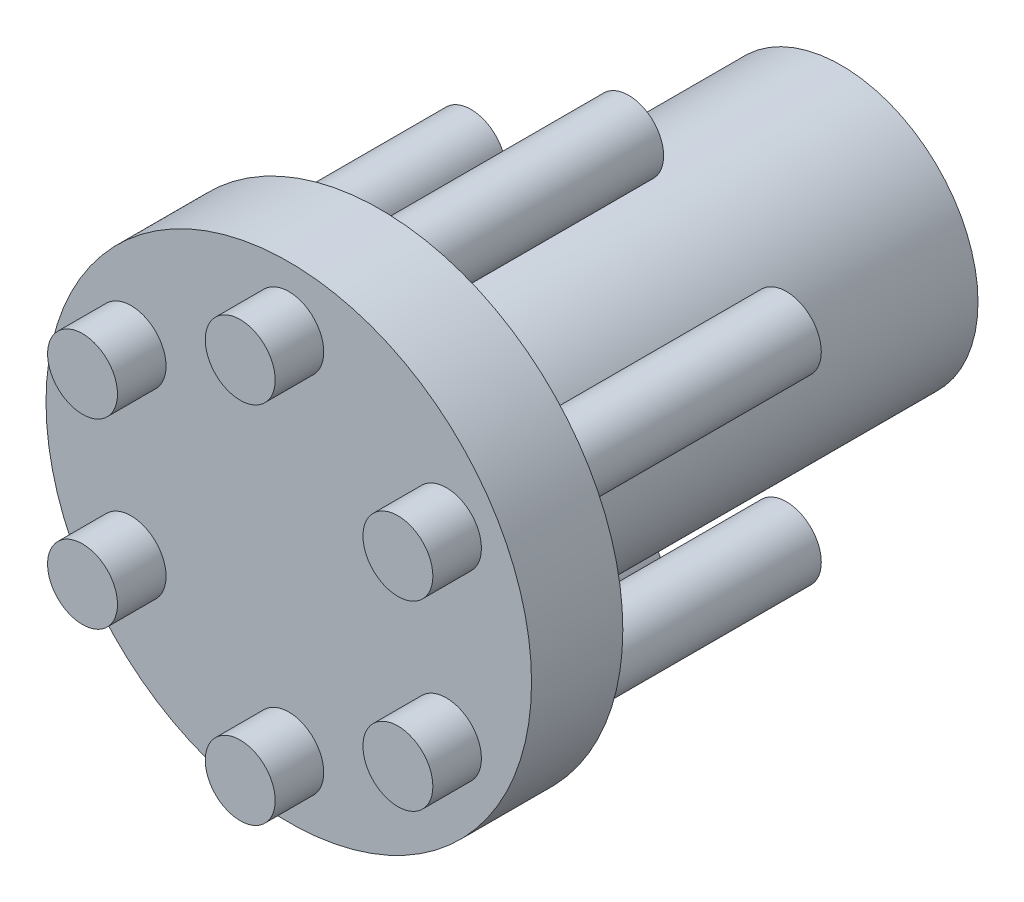
ISO-10303-21;
HEADER;
FILE_DESCRIPTION(('STEP AP214'),'2;1');
FILE_NAME('part.step','',(''),(''),'','','');
FILE_SCHEMA(('AUTOMOTIVE_DESIGN { 1 0 10303 214 1 1 1 1 }'));
ENDSEC;
DATA;
#1=APPLICATION_CONTEXT('core data for automotive mechanical design processes');
#2=APPLICATION_PROTOCOL_DEFINITION('international standard','automotive_design',2000,#1);
#3=PRODUCT_CONTEXT('',#1,'mechanical');
#4=PRODUCT('Part','Part','',(#3));
#5=PRODUCT_RELATED_PRODUCT_CATEGORY('part','',(#4));
#6=PRODUCT_DEFINITION_FORMATION('','',#4);
#7=PRODUCT_DEFINITION_CONTEXT('part definition',#1,'design');
#8=PRODUCT_DEFINITION('design','',#6,#7);
#9=PRODUCT_DEFINITION_SHAPE('','',#8);
#10=(LENGTH_UNIT() NAMED_UNIT(*) SI_UNIT(.MILLI.,.METRE.));
#11=(NAMED_UNIT(*) PLANE_ANGLE_UNIT() SI_UNIT($,.RADIAN.));
#12=(NAMED_UNIT(*) SI_UNIT($,.STERADIAN.) SOLID_ANGLE_UNIT());
#13=UNCERTAINTY_MEASURE_WITH_UNIT(LENGTH_MEASURE(1.E-05),#10,'distance_accuracy_value','');
#14=(GEOMETRIC_REPRESENTATION_CONTEXT(3) GLOBAL_UNCERTAINTY_ASSIGNED_CONTEXT((#13)) GLOBAL_UNIT_ASSIGNED_CONTEXT((#10,
#11,#12)) REPRESENTATION_CONTEXT('',''));
#15=CARTESIAN_POINT('',(0.,0.,0.));
#16=DIRECTION('',(0.,0.,1.));
#17=DIRECTION('',(1.,0.,0.));
#18=AXIS2_PLACEMENT_3D('',#15,#16,#17);
#19=CARTESIAN_POINT('',(0.,0.,0.));
#20=DIRECTION('',(0.,0.,1.));
#21=DIRECTION('',(1.,0.,0.));
#22=AXIS2_PLACEMENT_3D('',#19,#20,#21);
#23=PLANE('',#22);
#24=CARTESIAN_POINT('',(-8.24889197104655,4.76249999999958,0.));
#25=DIRECTION('',(0.,0.,1.));
#26=DIRECTION('',(1.,0.,0.));
#27=AXIS2_PLACEMENT_3D('',#24,#25,#26);
#28=CIRCLE('',#27,1.8288);
#29=CARTESIAN_POINT('',(-6.42009197104655,4.76249999999958,0.));
#30=VERTEX_POINT('',#29);
#31=EDGE_CURVE('E116',#30,#30,#28,.T.);
#32=ORIENTED_EDGE('',*,*,#31,.T.);
#33=EDGE_LOOP('',(#32));
#34=FACE_BOUND('',#33,.T.);
#35=CARTESIAN_POINT('',(-8.24889197104607,-4.76250000000041,0.));
#36=DIRECTION('',(0.,0.,1.));
#37=DIRECTION('',(1.,0.,0.));
#38=AXIS2_PLACEMENT_3D('',#35,#36,#37);
#39=CIRCLE('',#38,1.8288);
#40=CARTESIAN_POINT('',(-6.42009197104607,-4.76250000000041,0.));
#41=VERTEX_POINT('',#40);
#42=EDGE_CURVE('E107',#41,#41,#39,.T.);
#43=ORIENTED_EDGE('',*,*,#42,.T.);
#44=EDGE_LOOP('',(#43));
#45=FACE_BOUND('',#44,.T.);
#46=CARTESIAN_POINT('',(9.44592547945624E-13,-9.525,0.));
#47=DIRECTION('',(0.,0.,1.));
#48=DIRECTION('',(1.,0.,0.));
#49=AXIS2_PLACEMENT_3D('',#46,#47,#48);
#50=CIRCLE('',#49,1.8288);
#51=CARTESIAN_POINT('',(1.82880000000094,-9.525,0.));
#52=VERTEX_POINT('',#51);
#53=EDGE_CURVE('E98',#52,#52,#50,.T.);
#54=ORIENTED_EDGE('',*,*,#53,.T.);
#55=EDGE_LOOP('',(#54));
#56=FACE_BOUND('',#55,.T.);
#57=CARTESIAN_POINT('',(8.24889197104749,-4.76249999999959,0.));
#58=DIRECTION('',(0.,0.,1.));
#59=DIRECTION('',(1.,0.,0.));
#60=AXIS2_PLACEMENT_3D('',#57,#58,#59);
#61=CIRCLE('',#60,1.8288);
#62=CARTESIAN_POINT('',(10.0776919710475,-4.76249999999959,0.));
#63=VERTEX_POINT('',#62);
#64=EDGE_CURVE('E89',#63,#63,#61,.T.);
#65=ORIENTED_EDGE('',*,*,#64,.T.);
#66=EDGE_LOOP('',(#65));
#67=FACE_BOUND('',#66,.T.);
#68=CARTESIAN_POINT('',(8.24889197104701,4.76250000000041,0.));
#69=DIRECTION('',(0.,0.,1.));
#70=DIRECTION('',(1.,0.,0.));
#71=AXIS2_PLACEMENT_3D('',#68,#69,#70);
#72=CIRCLE('',#71,1.8288);
#73=CARTESIAN_POINT('',(10.077691971047,4.76250000000041,0.));
#74=VERTEX_POINT('',#73);
#75=EDGE_CURVE('E80',#74,#74,#72,.T.);
#76=ORIENTED_EDGE('',*,*,#75,.T.);
#77=EDGE_LOOP('',(#76));
#78=FACE_BOUND('',#77,.T.);
#79=CARTESIAN_POINT('',(0.,9.525,0.));
#80=DIRECTION('',(0.,0.,1.));
#81=DIRECTION('',(1.,0.,0.));
#82=AXIS2_PLACEMENT_3D('',#79,#80,#81);
#83=CIRCLE('',#82,1.8288);
#84=CARTESIAN_POINT('',(1.8288,9.525,0.));
#85=VERTEX_POINT('',#84);
#86=EDGE_CURVE('E71',#85,#85,#83,.T.);
#87=ORIENTED_EDGE('',*,*,#86,.T.);
#88=EDGE_LOOP('',(#87));
#89=FACE_BOUND('',#88,.T.);
#90=CARTESIAN_POINT('',(0.,0.,0.));
#91=DIRECTION('',(0.,0.,1.));
#92=DIRECTION('',(1.,0.,0.));
#93=AXIS2_PLACEMENT_3D('',#90,#91,#92);
#94=CIRCLE('',#93,12.7);
#95=CARTESIAN_POINT('',(12.7,0.,0.));
#96=VERTEX_POINT('',#95);
#97=EDGE_CURVE('E63',#96,#96,#94,.T.);
#98=ORIENTED_EDGE('',*,*,#97,.F.);
#99=EDGE_LOOP('',(#98));
#100=FACE_BOUND('',#99,.T.);
#101=CARTESIAN_POINT('',(0.,0.,0.));
#102=DIRECTION('',(0.,0.,1.));
#103=DIRECTION('',(1.,0.,0.));
#104=AXIS2_PLACEMENT_3D('',#101,#102,#103);
#105=CIRCLE('',#104,7.1501);
#106=CARTESIAN_POINT('',(7.1501,0.,0.));
#107=VERTEX_POINT('',#106);
#108=EDGE_CURVE('E59',#107,#107,#105,.F.);
#109=ORIENTED_EDGE('',*,*,#108,.F.);
#110=EDGE_LOOP('',(#109));
#111=FACE_BOUND('',#110,.T.);
#112=ADVANCED_FACE('F33',(#34,#45,#56,#67,#78,#89,#100,#111),#23,.F.);
#113=CARTESIAN_POINT('',(0.,0.,4.7752));
#114=DIRECTION('',(0.,0.,-1.));
#115=DIRECTION('',(-1.,0.,0.));
#116=AXIS2_PLACEMENT_3D('',#113,#114,#115);
#117=CYLINDRICAL_SURFACE('',#116,12.7);
#118=CARTESIAN_POINT('',(0.,0.,4.7752));
#119=DIRECTION('',(0.,0.,1.));
#120=DIRECTION('',(1.,0.,0.));
#121=AXIS2_PLACEMENT_3D('',#118,#119,#120);
#122=CIRCLE('',#121,12.7);
#123=CARTESIAN_POINT('',(12.7,0.,4.7752));
#124=VERTEX_POINT('',#123);
#125=EDGE_CURVE('E62',#124,#124,#122,.T.);
#126=ORIENTED_EDGE('',*,*,#125,.F.);
#127=EDGE_LOOP('',(#126));
#128=FACE_BOUND('',#127,.T.);
#129=ORIENTED_EDGE('',*,*,#97,.T.);
#130=EDGE_LOOP('',(#129));
#131=FACE_BOUND('',#130,.T.);
#132=ADVANCED_FACE('F35',(#128,#131),#117,.T.);
#133=CARTESIAN_POINT('',(0.,0.,4.7752));
#134=DIRECTION('',(0.,0.,1.));
#135=DIRECTION('',(1.,0.,0.));
#136=AXIS2_PLACEMENT_3D('',#133,#134,#135);
#137=PLANE('',#136);
#138=CARTESIAN_POINT('',(-8.24889197104655,4.76249999999958,4.7752));
#139=DIRECTION('',(0.,0.,1.));
#140=DIRECTION('',(1.,0.,0.));
#141=AXIS2_PLACEMENT_3D('',#138,#139,#140);
#142=CIRCLE('',#141,1.8288);
#143=CARTESIAN_POINT('',(-6.42009197104655,4.76249999999958,4.7752));
#144=VERTEX_POINT('',#143);
#145=EDGE_CURVE('E10',#144,#144,#142,.T.);
#146=ORIENTED_EDGE('',*,*,#145,.F.);
#147=EDGE_LOOP('',(#146));
#148=FACE_BOUND('',#147,.T.);
#149=CARTESIAN_POINT('',(-8.24889197104607,-4.76250000000041,4.7752));
#150=DIRECTION('',(0.,0.,1.));
#151=DIRECTION('',(1.,0.,0.));
#152=AXIS2_PLACEMENT_3D('',#149,#150,#151);
#153=CIRCLE('',#152,1.8288);
#154=CARTESIAN_POINT('',(-6.42009197104607,-4.76250000000041,4.7752));
#155=VERTEX_POINT('',#154);
#156=EDGE_CURVE('E40',#155,#155,#153,.T.);
#157=ORIENTED_EDGE('',*,*,#156,.F.);
#158=EDGE_LOOP('',(#157));
#159=FACE_BOUND('',#158,.T.);
#160=CARTESIAN_POINT('',(9.44592547945624E-13,-9.525,4.7752));
#161=DIRECTION('',(0.,0.,1.));
#162=DIRECTION('',(1.,0.,0.));
#163=AXIS2_PLACEMENT_3D('',#160,#161,#162);
#164=CIRCLE('',#163,1.8288);
#165=CARTESIAN_POINT('',(1.82880000000094,-9.525,4.7752));
#166=VERTEX_POINT('',#165);
#167=EDGE_CURVE('E44',#166,#166,#164,.T.);
#168=ORIENTED_EDGE('',*,*,#167,.F.);
#169=EDGE_LOOP('',(#168));
#170=FACE_BOUND('',#169,.T.);
#171=CARTESIAN_POINT('',(8.24889197104749,-4.76249999999959,4.7752));
#172=DIRECTION('',(0.,0.,1.));
#173=DIRECTION('',(1.,0.,0.));
#174=AXIS2_PLACEMENT_3D('',#171,#172,#173);
#175=CIRCLE('',#174,1.8288);
#176=CARTESIAN_POINT('',(10.0776919710475,-4.76249999999959,4.7752));
#177=VERTEX_POINT('',#176);
#178=EDGE_CURVE('E48',#177,#177,#175,.T.);
#179=ORIENTED_EDGE('',*,*,#178,.F.);
#180=EDGE_LOOP('',(#179));
#181=FACE_BOUND('',#180,.T.);
#182=CARTESIAN_POINT('',(8.24889197104701,4.76250000000041,4.7752));
#183=DIRECTION('',(0.,0.,1.));
#184=DIRECTION('',(1.,0.,0.));
#185=AXIS2_PLACEMENT_3D('',#182,#183,#184);
#186=CIRCLE('',#185,1.8288);
#187=CARTESIAN_POINT('',(10.077691971047,4.76250000000041,4.7752));
#188=VERTEX_POINT('',#187);
#189=EDGE_CURVE('E53',#188,#188,#186,.T.);
#190=ORIENTED_EDGE('',*,*,#189,.F.);
#191=EDGE_LOOP('',(#190));
#192=FACE_BOUND('',#191,.T.);
#193=CARTESIAN_POINT('',(0.,9.525,4.7752));
#194=DIRECTION('',(0.,0.,1.));
#195=DIRECTION('',(1.,0.,0.));
#196=AXIS2_PLACEMENT_3D('',#193,#194,#195);
#197=CIRCLE('',#196,1.8288);
#198=CARTESIAN_POINT('',(1.8288,9.525,4.7752));
#199=VERTEX_POINT('',#198);
#200=EDGE_CURVE('E56',#199,#199,#197,.T.);
#201=ORIENTED_EDGE('',*,*,#200,.F.);
#202=EDGE_LOOP('',(#201));
#203=FACE_BOUND('',#202,.T.);
#204=ORIENTED_EDGE('',*,*,#125,.T.);
#205=EDGE_LOOP('',(#204));
#206=FACE_BOUND('',#205,.T.);
#207=ADVANCED_FACE('F147',(#148,#159,#170,#181,#192,#203,#206),#137,.T.);
#208=CARTESIAN_POINT('',(0.,0.,-24.13));
#209=DIRECTION('',(0.,0.,1.));
#210=DIRECTION('',(1.,0.,0.));
#211=AXIS2_PLACEMENT_3D('',#208,#209,#210);
#212=CYLINDRICAL_SURFACE('',#211,7.1501);
#213=CARTESIAN_POINT('',(0.,0.,-24.13));
#214=DIRECTION('',(0.,0.,-1.));
#215=DIRECTION('',(-1.,0.,0.));
#216=AXIS2_PLACEMENT_3D('',#213,#214,#215);
#217=CIRCLE('',#216,7.1501);
#218=CARTESIAN_POINT('',(-7.1501,0.,-24.13));
#219=VERTEX_POINT('',#218);
#220=EDGE_CURVE('E66',#219,#219,#217,.T.);
#221=ORIENTED_EDGE('',*,*,#220,.F.);
#222=EDGE_LOOP('',(#221));
#223=FACE_BOUND('',#222,.T.);
#224=ORIENTED_EDGE('',*,*,#108,.T.);
#225=EDGE_LOOP('',(#224));
#226=FACE_BOUND('',#225,.T.);
#227=ADVANCED_FACE('F153',(#223,#226),#212,.T.);
#228=CARTESIAN_POINT('',(0.,0.,-24.13));
#229=DIRECTION('',(0.,0.,-1.));
#230=DIRECTION('',(-1.,0.,0.));
#231=AXIS2_PLACEMENT_3D('',#228,#229,#230);
#232=PLANE('',#231);
#233=ORIENTED_EDGE('',*,*,#220,.T.);
#234=EDGE_LOOP('',(#233));
#235=FACE_BOUND('',#234,.T.);
#236=ADVANCED_FACE('F157',(#235),#232,.T.);
#237=CARTESIAN_POINT('',(0.,9.525,7.3152));
#238=DIRECTION('',(0.,0.,1.));
#239=DIRECTION('',(1.,0.,0.));
#240=AXIS2_PLACEMENT_3D('',#237,#238,#239);
#241=PLANE('',#240);
#242=CARTESIAN_POINT('',(0.,9.525,7.3152));
#243=DIRECTION('',(0.,0.,1.));
#244=DIRECTION('',(1.,0.,0.));
#245=AXIS2_PLACEMENT_3D('',#242,#243,#244);
#246=CIRCLE('',#245,1.8288);
#247=CARTESIAN_POINT('',(1.8288,9.525,7.3152));
#248=VERTEX_POINT('',#247);
#249=EDGE_CURVE('E77',#248,#248,#246,.T.);
#250=ORIENTED_EDGE('',*,*,#249,.T.);
#251=EDGE_LOOP('',(#250));
#252=FACE_BOUND('',#251,.T.);
#253=ADVANCED_FACE('F161',(#252),#241,.T.);
#254=CARTESIAN_POINT('',(0.,9.525,-13.0048));
#255=DIRECTION('',(0.,0.,1.));
#256=DIRECTION('',(1.,0.,0.));
#257=AXIS2_PLACEMENT_3D('',#254,#255,#256);
#258=CYLINDRICAL_SURFACE('',#257,1.8288);
#259=ORIENTED_EDGE('',*,*,#200,.T.);
#260=EDGE_LOOP('',(#259));
#261=FACE_BOUND('',#260,.T.);
#262=ORIENTED_EDGE('',*,*,#249,.F.);
#263=EDGE_LOOP('',(#262));
#264=FACE_BOUND('',#263,.T.);
#265=ADVANCED_FACE('F163',(#261,#264),#258,.T.);
#266=CARTESIAN_POINT('',(0.,9.525,-13.0048));
#267=DIRECTION('',(0.,0.,1.));
#268=DIRECTION('',(1.,0.,0.));
#269=AXIS2_PLACEMENT_3D('',#266,#267,#268);
#270=CIRCLE('',#269,1.8288);
#271=CARTESIAN_POINT('',(1.8288,9.525,-13.0048));
#272=VERTEX_POINT('',#271);
#273=EDGE_CURVE('E74',#272,#272,#270,.T.);
#274=ORIENTED_EDGE('',*,*,#273,.T.);
#275=EDGE_LOOP('',(#274));
#276=FACE_BOUND('',#275,.T.);
#277=ORIENTED_EDGE('',*,*,#86,.F.);
#278=EDGE_LOOP('',(#277));
#279=FACE_BOUND('',#278,.T.);
#280=ADVANCED_FACE('F166',(#276,#279),#258,.T.);
#281=CARTESIAN_POINT('',(0.,9.525,-13.0048));
#282=DIRECTION('',(0.,0.,1.));
#283=DIRECTION('',(1.,0.,0.));
#284=AXIS2_PLACEMENT_3D('',#281,#282,#283);
#285=PLANE('',#284);
#286=ORIENTED_EDGE('',*,*,#273,.F.);
#287=EDGE_LOOP('',(#286));
#288=FACE_BOUND('',#287,.T.);
#289=ADVANCED_FACE('F168',(#288),#285,.F.);
#290=CARTESIAN_POINT('',(8.24889197104701,4.76250000000041,7.3152));
#291=DIRECTION('',(0.,0.,1.));
#292=DIRECTION('',(1.,0.,0.));
#293=AXIS2_PLACEMENT_3D('',#290,#291,#292);
#294=PLANE('',#293);
#295=CARTESIAN_POINT('',(8.24889197104701,4.76250000000041,7.3152));
#296=DIRECTION('',(0.,0.,1.));
#297=DIRECTION('',(1.,0.,0.));
#298=AXIS2_PLACEMENT_3D('',#295,#296,#297);
#299=CIRCLE('',#298,1.8288);
#300=CARTESIAN_POINT('',(10.077691971047,4.76250000000041,7.3152));
#301=VERTEX_POINT('',#300);
#302=EDGE_CURVE('E86',#301,#301,#299,.T.);
#303=ORIENTED_EDGE('',*,*,#302,.T.);
#304=EDGE_LOOP('',(#303));
#305=FACE_BOUND('',#304,.T.);
#306=ADVANCED_FACE('F171',(#305),#294,.T.);
#307=CARTESIAN_POINT('',(8.24889197104701,4.76250000000041,-13.0048));
#308=DIRECTION('',(0.,0.,1.));
#309=DIRECTION('',(1.,0.,0.));
#310=AXIS2_PLACEMENT_3D('',#307,#308,#309);
#311=CYLINDRICAL_SURFACE('',#310,1.8288);
#312=ORIENTED_EDGE('',*,*,#189,.T.);
#313=EDGE_LOOP('',(#312));
#314=FACE_BOUND('',#313,.T.);
#315=ORIENTED_EDGE('',*,*,#302,.F.);
#316=EDGE_LOOP('',(#315));
#317=FACE_BOUND('',#316,.T.);
#318=ADVANCED_FACE('F176',(#314,#317),#311,.T.);
#319=CARTESIAN_POINT('',(8.24889197104701,4.76250000000041,-13.0048));
#320=DIRECTION('',(0.,0.,1.));
#321=DIRECTION('',(1.,0.,0.));
#322=AXIS2_PLACEMENT_3D('',#319,#320,#321);
#323=CIRCLE('',#322,1.8288);
#324=CARTESIAN_POINT('',(10.077691971047,4.76250000000041,-13.0048));
#325=VERTEX_POINT('',#324);
#326=EDGE_CURVE('E83',#325,#325,#323,.T.);
#327=ORIENTED_EDGE('',*,*,#326,.T.);
#328=EDGE_LOOP('',(#327));
#329=FACE_BOUND('',#328,.T.);
#330=ORIENTED_EDGE('',*,*,#75,.F.);
#331=EDGE_LOOP('',(#330));
#332=FACE_BOUND('',#331,.T.);
#333=ADVANCED_FACE('F179',(#329,#332),#311,.T.);
#334=CARTESIAN_POINT('',(8.24889197104701,4.76250000000041,-13.0048));
#335=DIRECTION('',(0.,0.,1.));
#336=DIRECTION('',(1.,0.,0.));
#337=AXIS2_PLACEMENT_3D('',#334,#335,#336);
#338=PLANE('',#337);
#339=ORIENTED_EDGE('',*,*,#326,.F.);
#340=EDGE_LOOP('',(#339));
#341=FACE_BOUND('',#340,.T.);
#342=ADVANCED_FACE('F181',(#341),#338,.F.);
#343=CARTESIAN_POINT('',(8.24889197104749,-4.76249999999959,7.3152));
#344=DIRECTION('',(0.,0.,1.));
#345=DIRECTION('',(1.,0.,0.));
#346=AXIS2_PLACEMENT_3D('',#343,#344,#345);
#347=PLANE('',#346);
#348=CARTESIAN_POINT('',(8.24889197104749,-4.76249999999959,7.3152));
#349=DIRECTION('',(0.,0.,1.));
#350=DIRECTION('',(1.,0.,0.));
#351=AXIS2_PLACEMENT_3D('',#348,#349,#350);
#352=CIRCLE('',#351,1.8288);
#353=CARTESIAN_POINT('',(10.0776919710475,-4.76249999999959,7.3152));
#354=VERTEX_POINT('',#353);
#355=EDGE_CURVE('E95',#354,#354,#352,.T.);
#356=ORIENTED_EDGE('',*,*,#355,.T.);
#357=EDGE_LOOP('',(#356));
#358=FACE_BOUND('',#357,.T.);
#359=ADVANCED_FACE('F184',(#358),#347,.T.);
#360=CARTESIAN_POINT('',(8.24889197104749,-4.76249999999959,-13.0048));
#361=DIRECTION('',(0.,0.,1.));
#362=DIRECTION('',(1.,0.,0.));
#363=AXIS2_PLACEMENT_3D('',#360,#361,#362);
#364=CYLINDRICAL_SURFACE('',#363,1.8288);
#365=ORIENTED_EDGE('',*,*,#178,.T.);
#366=EDGE_LOOP('',(#365));
#367=FACE_BOUND('',#366,.T.);
#368=ORIENTED_EDGE('',*,*,#355,.F.);
#369=EDGE_LOOP('',(#368));
#370=FACE_BOUND('',#369,.T.);
#371=ADVANCED_FACE('F189',(#367,#370),#364,.T.);
#372=CARTESIAN_POINT('',(8.24889197104749,-4.76249999999959,-13.0048));
#373=DIRECTION('',(0.,0.,1.));
#374=DIRECTION('',(1.,0.,0.));
#375=AXIS2_PLACEMENT_3D('',#372,#373,#374);
#376=CIRCLE('',#375,1.8288);
#377=CARTESIAN_POINT('',(10.0776919710475,-4.76249999999959,-13.0048));
#378=VERTEX_POINT('',#377);
#379=EDGE_CURVE('E92',#378,#378,#376,.T.);
#380=ORIENTED_EDGE('',*,*,#379,.T.);
#381=EDGE_LOOP('',(#380));
#382=FACE_BOUND('',#381,.T.);
#383=ORIENTED_EDGE('',*,*,#64,.F.);
#384=EDGE_LOOP('',(#383));
#385=FACE_BOUND('',#384,.T.);
#386=ADVANCED_FACE('F192',(#382,#385),#364,.T.);
#387=CARTESIAN_POINT('',(8.24889197104749,-4.76249999999959,-13.0048));
#388=DIRECTION('',(0.,0.,1.));
#389=DIRECTION('',(1.,0.,0.));
#390=AXIS2_PLACEMENT_3D('',#387,#388,#389);
#391=PLANE('',#390);
#392=ORIENTED_EDGE('',*,*,#379,.F.);
#393=EDGE_LOOP('',(#392));
#394=FACE_BOUND('',#393,.T.);
#395=ADVANCED_FACE('F194',(#394),#391,.F.);
#396=CARTESIAN_POINT('',(9.44592547945624E-13,-9.525,7.3152));
#397=DIRECTION('',(0.,0.,1.));
#398=DIRECTION('',(1.,0.,0.));
#399=AXIS2_PLACEMENT_3D('',#396,#397,#398);
#400=PLANE('',#399);
#401=CARTESIAN_POINT('',(9.44592547945624E-13,-9.525,7.3152));
#402=DIRECTION('',(0.,0.,1.));
#403=DIRECTION('',(1.,0.,0.));
#404=AXIS2_PLACEMENT_3D('',#401,#402,#403);
#405=CIRCLE('',#404,1.8288);
#406=CARTESIAN_POINT('',(1.82880000000094,-9.525,7.3152));
#407=VERTEX_POINT('',#406);
#408=EDGE_CURVE('E104',#407,#407,#405,.T.);
#409=ORIENTED_EDGE('',*,*,#408,.T.);
#410=EDGE_LOOP('',(#409));
#411=FACE_BOUND('',#410,.T.);
#412=ADVANCED_FACE('F197',(#411),#400,.T.);
#413=CARTESIAN_POINT('',(9.44592547945624E-13,-9.525,-13.0048));
#414=DIRECTION('',(0.,0.,1.));
#415=DIRECTION('',(1.,0.,0.));
#416=AXIS2_PLACEMENT_3D('',#413,#414,#415);
#417=CYLINDRICAL_SURFACE('',#416,1.8288);
#418=ORIENTED_EDGE('',*,*,#167,.T.);
#419=EDGE_LOOP('',(#418));
#420=FACE_BOUND('',#419,.T.);
#421=ORIENTED_EDGE('',*,*,#408,.F.);
#422=EDGE_LOOP('',(#421));
#423=FACE_BOUND('',#422,.T.);
#424=ADVANCED_FACE('F202',(#420,#423),#417,.T.);
#425=CARTESIAN_POINT('',(9.44592547945624E-13,-9.525,-13.0048));
#426=DIRECTION('',(0.,0.,1.));
#427=DIRECTION('',(1.,0.,0.));
#428=AXIS2_PLACEMENT_3D('',#425,#426,#427);
#429=CIRCLE('',#428,1.8288);
#430=CARTESIAN_POINT('',(1.82880000000094,-9.525,-13.0048));
#431=VERTEX_POINT('',#430);
#432=EDGE_CURVE('E101',#431,#431,#429,.T.);
#433=ORIENTED_EDGE('',*,*,#432,.T.);
#434=EDGE_LOOP('',(#433));
#435=FACE_BOUND('',#434,.T.);
#436=ORIENTED_EDGE('',*,*,#53,.F.);
#437=EDGE_LOOP('',(#436));
#438=FACE_BOUND('',#437,.T.);
#439=ADVANCED_FACE('F205',(#435,#438),#417,.T.);
#440=CARTESIAN_POINT('',(9.44592547945624E-13,-9.525,-13.0048));
#441=DIRECTION('',(0.,0.,1.));
#442=DIRECTION('',(1.,0.,0.));
#443=AXIS2_PLACEMENT_3D('',#440,#441,#442);
#444=PLANE('',#443);
#445=ORIENTED_EDGE('',*,*,#432,.F.);
#446=EDGE_LOOP('',(#445));
#447=FACE_BOUND('',#446,.T.);
#448=ADVANCED_FACE('F207',(#447),#444,.F.);
#449=CARTESIAN_POINT('',(-8.24889197104607,-4.76250000000041,7.3152));
#450=DIRECTION('',(0.,0.,1.));
#451=DIRECTION('',(1.,0.,0.));
#452=AXIS2_PLACEMENT_3D('',#449,#450,#451);
#453=PLANE('',#452);
#454=CARTESIAN_POINT('',(-8.24889197104607,-4.76250000000041,7.3152));
#455=DIRECTION('',(0.,0.,1.));
#456=DIRECTION('',(1.,0.,0.));
#457=AXIS2_PLACEMENT_3D('',#454,#455,#456);
#458=CIRCLE('',#457,1.8288);
#459=CARTESIAN_POINT('',(-6.42009197104607,-4.76250000000041,7.3152));
#460=VERTEX_POINT('',#459);
#461=EDGE_CURVE('E113',#460,#460,#458,.T.);
#462=ORIENTED_EDGE('',*,*,#461,.T.);
#463=EDGE_LOOP('',(#462));
#464=FACE_BOUND('',#463,.T.);
#465=ADVANCED_FACE('F210',(#464),#453,.T.);
#466=CARTESIAN_POINT('',(-8.24889197104607,-4.76250000000041,-13.0048));
#467=DIRECTION('',(0.,0.,1.));
#468=DIRECTION('',(1.,0.,0.));
#469=AXIS2_PLACEMENT_3D('',#466,#467,#468);
#470=CYLINDRICAL_SURFACE('',#469,1.8288);
#471=ORIENTED_EDGE('',*,*,#156,.T.);
#472=EDGE_LOOP('',(#471));
#473=FACE_BOUND('',#472,.T.);
#474=ORIENTED_EDGE('',*,*,#461,.F.);
#475=EDGE_LOOP('',(#474));
#476=FACE_BOUND('',#475,.T.);
#477=ADVANCED_FACE('F215',(#473,#476),#470,.T.);
#478=CARTESIAN_POINT('',(-8.24889197104607,-4.76250000000041,-13.0048));
#479=DIRECTION('',(0.,0.,1.));
#480=DIRECTION('',(1.,0.,0.));
#481=AXIS2_PLACEMENT_3D('',#478,#479,#480);
#482=CIRCLE('',#481,1.8288);
#483=CARTESIAN_POINT('',(-6.42009197104607,-4.76250000000041,-13.0048));
#484=VERTEX_POINT('',#483);
#485=EDGE_CURVE('E110',#484,#484,#482,.T.);
#486=ORIENTED_EDGE('',*,*,#485,.T.);
#487=EDGE_LOOP('',(#486));
#488=FACE_BOUND('',#487,.T.);
#489=ORIENTED_EDGE('',*,*,#42,.F.);
#490=EDGE_LOOP('',(#489));
#491=FACE_BOUND('',#490,.T.);
#492=ADVANCED_FACE('F218',(#488,#491),#470,.T.);
#493=CARTESIAN_POINT('',(-8.24889197104607,-4.76250000000041,-13.0048));
#494=DIRECTION('',(0.,0.,1.));
#495=DIRECTION('',(1.,0.,0.));
#496=AXIS2_PLACEMENT_3D('',#493,#494,#495);
#497=PLANE('',#496);
#498=ORIENTED_EDGE('',*,*,#485,.F.);
#499=EDGE_LOOP('',(#498));
#500=FACE_BOUND('',#499,.T.);
#501=ADVANCED_FACE('F138',(#500),#497,.F.);
#502=CARTESIAN_POINT('',(-8.24889197104655,4.76249999999958,7.3152));
#503=DIRECTION('',(0.,0.,1.));
#504=DIRECTION('',(1.,0.,0.));
#505=AXIS2_PLACEMENT_3D('',#502,#503,#504);
#506=PLANE('',#505);
#507=CARTESIAN_POINT('',(-8.24889197104655,4.76249999999958,7.3152));
#508=DIRECTION('',(0.,0.,1.));
#509=DIRECTION('',(1.,0.,0.));
#510=AXIS2_PLACEMENT_3D('',#507,#508,#509);
#511=CIRCLE('',#510,1.8288);
#512=CARTESIAN_POINT('',(-6.42009197104655,4.76249999999958,7.3152));
#513=VERTEX_POINT('',#512);
#514=EDGE_CURVE('E122',#513,#513,#511,.T.);
#515=ORIENTED_EDGE('',*,*,#514,.T.);
#516=EDGE_LOOP('',(#515));
#517=FACE_BOUND('',#516,.T.);
#518=ADVANCED_FACE('F126',(#517),#506,.T.);
#519=CARTESIAN_POINT('',(-8.24889197104655,4.76249999999958,-13.0048));
#520=DIRECTION('',(0.,0.,1.));
#521=DIRECTION('',(1.,0.,0.));
#522=AXIS2_PLACEMENT_3D('',#519,#520,#521);
#523=CYLINDRICAL_SURFACE('',#522,1.8288);
#524=ORIENTED_EDGE('',*,*,#145,.T.);
#525=EDGE_LOOP('',(#524));
#526=FACE_BOUND('',#525,.T.);
#527=ORIENTED_EDGE('',*,*,#514,.F.);
#528=EDGE_LOOP('',(#527));
#529=FACE_BOUND('',#528,.T.);
#530=ADVANCED_FACE('F128',(#526,#529),#523,.T.);
#531=CARTESIAN_POINT('',(-8.24889197104655,4.76249999999958,-13.0048));
#532=DIRECTION('',(0.,0.,1.));
#533=DIRECTION('',(1.,0.,0.));
#534=AXIS2_PLACEMENT_3D('',#531,#532,#533);
#535=CIRCLE('',#534,1.8288);
#536=CARTESIAN_POINT('',(-6.42009197104655,4.76249999999958,-13.0048));
#537=VERTEX_POINT('',#536);
#538=EDGE_CURVE('E119',#537,#537,#535,.T.);
#539=ORIENTED_EDGE('',*,*,#538,.T.);
#540=EDGE_LOOP('',(#539));
#541=FACE_BOUND('',#540,.T.);
#542=ORIENTED_EDGE('',*,*,#31,.F.);
#543=EDGE_LOOP('',(#542));
#544=FACE_BOUND('',#543,.T.);
#545=ADVANCED_FACE('F130',(#541,#544),#523,.T.);
#546=CARTESIAN_POINT('',(-8.24889197104655,4.76249999999958,-13.0048));
#547=DIRECTION('',(0.,0.,1.));
#548=DIRECTION('',(1.,0.,0.));
#549=AXIS2_PLACEMENT_3D('',#546,#547,#548);
#550=PLANE('',#549);
#551=ORIENTED_EDGE('',*,*,#538,.F.);
#552=EDGE_LOOP('',(#551));
#553=FACE_BOUND('',#552,.T.);
#554=ADVANCED_FACE('F136',(#553),#550,.F.);
#555=CLOSED_SHELL('',(#112,#132,#207,#227,#236,#253,#265,#280,#289,#306,#318,#333,#342,#359,
#371,#386,#395,#412,#424,#439,#448,#465,#477,#492,#501,#518,#530,#545,#554));
#556=MANIFOLD_SOLID_BREP('B2',#555);
#557=ADVANCED_BREP_SHAPE_REPRESENTATION('',(#18,#556),#14);
#558=SHAPE_DEFINITION_REPRESENTATION(#9,#557);
ENDSEC;
END-ISO-10303-21;
